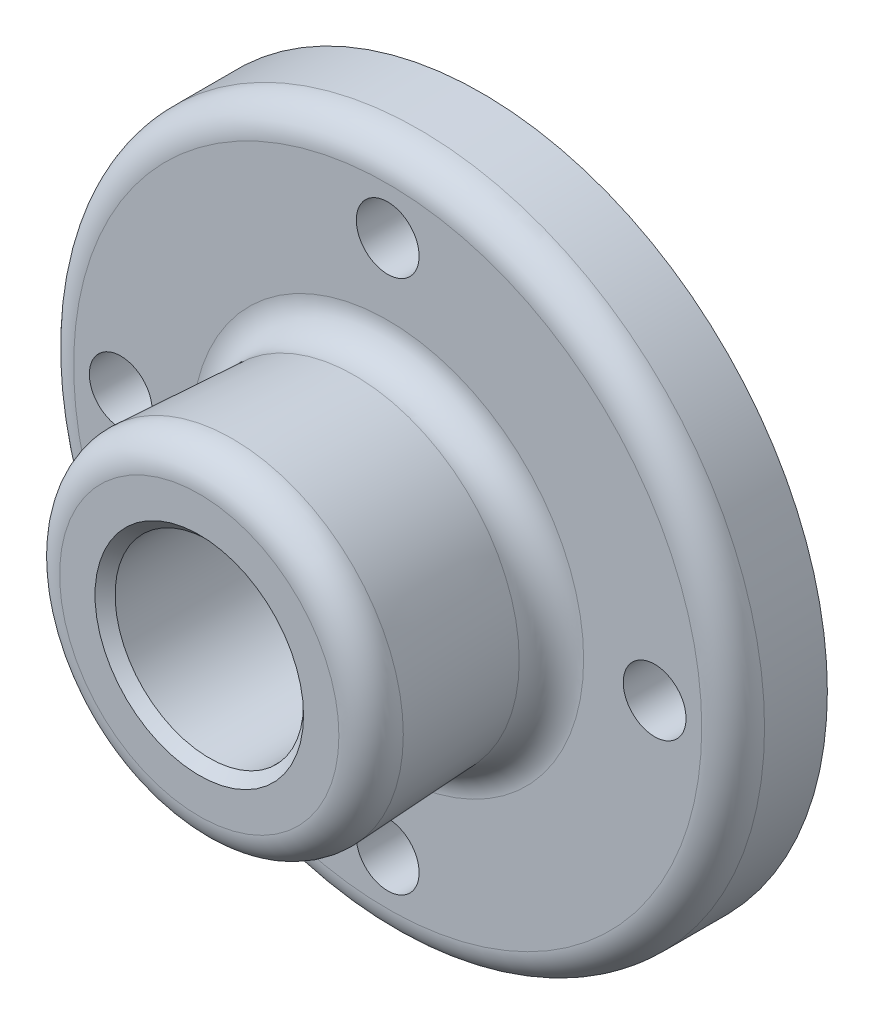
ISO-10303-21;
HEADER;
FILE_DESCRIPTION(('STEP AP214'),'2;1');
FILE_NAME('part.step','',(''),(''),'','','');
FILE_SCHEMA(('AUTOMOTIVE_DESIGN { 1 0 10303 214 1 1 1 1 }'));
ENDSEC;
DATA;
#1=APPLICATION_CONTEXT('core data for automotive mechanical design processes');
#2=APPLICATION_PROTOCOL_DEFINITION('international standard','automotive_design',2000,#1);
#3=PRODUCT_CONTEXT('',#1,'mechanical');
#4=PRODUCT('Part','Part','',(#3));
#5=PRODUCT_RELATED_PRODUCT_CATEGORY('part','',(#4));
#6=PRODUCT_DEFINITION_FORMATION('','',#4);
#7=PRODUCT_DEFINITION_CONTEXT('part definition',#1,'design');
#8=PRODUCT_DEFINITION('design','',#6,#7);
#9=PRODUCT_DEFINITION_SHAPE('','',#8);
#10=(LENGTH_UNIT() NAMED_UNIT(*) SI_UNIT(.MILLI.,.METRE.));
#11=(NAMED_UNIT(*) PLANE_ANGLE_UNIT() SI_UNIT($,.RADIAN.));
#12=(NAMED_UNIT(*) SI_UNIT($,.STERADIAN.) SOLID_ANGLE_UNIT());
#13=UNCERTAINTY_MEASURE_WITH_UNIT(LENGTH_MEASURE(1.E-05),#10,'distance_accuracy_value','');
#14=(GEOMETRIC_REPRESENTATION_CONTEXT(3) GLOBAL_UNCERTAINTY_ASSIGNED_CONTEXT((#13)) GLOBAL_UNIT_ASSIGNED_CONTEXT((#10,
#11,#12)) REPRESENTATION_CONTEXT('',''));
#15=CARTESIAN_POINT('',(0.,0.,0.));
#16=DIRECTION('',(0.,0.,1.));
#17=DIRECTION('',(1.,0.,0.));
#18=AXIS2_PLACEMENT_3D('',#15,#16,#17);
#19=CARTESIAN_POINT('',(0.,0.,19.05));
#20=DIRECTION('',(0.,0.,-1.));
#21=DIRECTION('',(-1.,0.,0.));
#22=AXIS2_PLACEMENT_3D('',#19,#20,#21);
#23=CYLINDRICAL_SURFACE('',#22,69.85);
#24=CARTESIAN_POINT('',(0.,0.,12.7));
#25=DIRECTION('',(0.,0.,1.));
#26=DIRECTION('',(1.,0.,0.));
#27=AXIS2_PLACEMENT_3D('',#24,#25,#26);
#28=CIRCLE('',#27,69.85);
#29=CARTESIAN_POINT('',(69.85,0.,12.7));
#30=VERTEX_POINT('',#29);
#31=EDGE_CURVE('E59',#30,#30,#28,.F.);
#32=ORIENTED_EDGE('',*,*,#31,.T.);
#33=EDGE_LOOP('',(#32));
#34=FACE_BOUND('',#33,.T.);
#35=CARTESIAN_POINT('',(0.,0.,0.));
#36=DIRECTION('',(0.,0.,1.));
#37=DIRECTION('',(1.,0.,0.));
#38=AXIS2_PLACEMENT_3D('',#35,#36,#37);
#39=CIRCLE('',#38,69.85);
#40=CARTESIAN_POINT('',(69.85,0.,0.));
#41=VERTEX_POINT('',#40);
#42=EDGE_CURVE('E68',#41,#41,#39,.T.);
#43=ORIENTED_EDGE('',*,*,#42,.T.);
#44=EDGE_LOOP('',(#43));
#45=FACE_BOUND('',#44,.T.);
#46=ADVANCED_FACE('F35',(#34,#45),#23,.T.);
#47=CARTESIAN_POINT('',(0.,0.,19.05));
#48=DIRECTION('',(0.,0.,1.));
#49=DIRECTION('',(1.,0.,0.));
#50=AXIS2_PLACEMENT_3D('',#47,#48,#49);
#51=PLANE('',#50);
#52=CARTESIAN_POINT('',(0.,0.,19.05));
#53=DIRECTION('',(0.,0.,1.));
#54=DIRECTION('',(1.,0.,0.));
#55=AXIS2_PLACEMENT_3D('',#52,#53,#54);
#56=CIRCLE('',#55,63.5);
#57=CARTESIAN_POINT('',(63.5,0.,19.05));
#58=VERTEX_POINT('',#57);
#59=EDGE_CURVE('E62',#58,#58,#56,.T.);
#60=ORIENTED_EDGE('',*,*,#59,.T.);
#61=EDGE_LOOP('',(#60));
#62=FACE_BOUND('',#61,.T.);
#63=CARTESIAN_POINT('',(0.,0.,19.05));
#64=DIRECTION('',(0.,0.,1.));
#65=DIRECTION('',(1.,0.,0.));
#66=AXIS2_PLACEMENT_3D('',#63,#64,#65);
#67=CIRCLE('',#66,39.6197674048502);
#68=CARTESIAN_POINT('',(39.6197674048502,0.,19.05));
#69=VERTEX_POINT('',#68);
#70=EDGE_CURVE('E65',#69,#69,#67,.F.);
#71=ORIENTED_EDGE('',*,*,#70,.T.);
#72=EDGE_LOOP('',(#71));
#73=FACE_BOUND('',#72,.T.);
#74=CARTESIAN_POINT('',(53.975,-1.88452705264058E-13,19.05));
#75=DIRECTION('',(0.,0.,1.));
#76=DIRECTION('',(0.,-1.,0.));
#77=AXIS2_PLACEMENT_3D('',#74,#75,#76);
#78=CIRCLE('',#77,6.35);
#79=CARTESIAN_POINT('',(53.975,-6.35000000000019,19.05));
#80=VERTEX_POINT('',#79);
#81=EDGE_CURVE('E93',#80,#80,#78,.T.);
#82=ORIENTED_EDGE('',*,*,#81,.F.);
#83=EDGE_LOOP('',(#82));
#84=FACE_BOUND('',#83,.T.);
#85=CARTESIAN_POINT('',(0.,-53.975,19.05));
#86=DIRECTION('',(0.,0.,1.));
#87=DIRECTION('',(-1.,0.,0.));
#88=AXIS2_PLACEMENT_3D('',#85,#86,#87);
#89=CIRCLE('',#88,6.35);
#90=CARTESIAN_POINT('',(-6.35,-53.975,19.05));
#91=VERTEX_POINT('',#90);
#92=EDGE_CURVE('E87',#91,#91,#89,.T.);
#93=ORIENTED_EDGE('',*,*,#92,.F.);
#94=EDGE_LOOP('',(#93));
#95=FACE_BOUND('',#94,.T.);
#96=CARTESIAN_POINT('',(-53.975,5.65358115792174E-13,19.05));
#97=DIRECTION('',(0.,0.,1.));
#98=DIRECTION('',(0.,1.,0.));
#99=AXIS2_PLACEMENT_3D('',#96,#97,#98);
#100=CIRCLE('',#99,6.35);
#101=CARTESIAN_POINT('',(-53.9749999999999,6.35000000000057,19.05));
#102=VERTEX_POINT('',#101);
#103=EDGE_CURVE('E81',#102,#102,#100,.T.);
#104=ORIENTED_EDGE('',*,*,#103,.F.);
#105=EDGE_LOOP('',(#104));
#106=FACE_BOUND('',#105,.T.);
#107=CARTESIAN_POINT('',(0.,53.975,19.05));
#108=DIRECTION('',(0.,0.,1.));
#109=DIRECTION('',(1.,0.,0.));
#110=AXIS2_PLACEMENT_3D('',#107,#108,#109);
#111=CIRCLE('',#110,6.35);
#112=CARTESIAN_POINT('',(6.35,53.975,19.05));
#113=VERTEX_POINT('',#112);
#114=EDGE_CURVE('E75',#113,#113,#111,.T.);
#115=ORIENTED_EDGE('',*,*,#114,.F.);
#116=EDGE_LOOP('',(#115));
#117=FACE_BOUND('',#116,.T.);
#118=ADVANCED_FACE('F110',(#62,#73,#84,#95,#106,#117),#51,.T.);
#119=CARTESIAN_POINT('',(0.,0.,0.));
#120=DIRECTION('',(0.,0.,1.));
#121=DIRECTION('',(1.,0.,0.));
#122=AXIS2_PLACEMENT_3D('',#119,#120,#121);
#123=PLANE('',#122);
#124=CARTESIAN_POINT('',(53.975,-1.88452705264058E-13,0.));
#125=DIRECTION('',(0.,0.,1.));
#126=DIRECTION('',(0.,-1.,0.));
#127=AXIS2_PLACEMENT_3D('',#124,#125,#126);
#128=CIRCLE('',#127,6.35);
#129=CARTESIAN_POINT('',(53.975,-6.35000000000019,0.));
#130=VERTEX_POINT('',#129);
#131=EDGE_CURVE('E78',#130,#130,#128,.T.);
#132=ORIENTED_EDGE('',*,*,#131,.T.);
#133=EDGE_LOOP('',(#132));
#134=FACE_BOUND('',#133,.T.);
#135=CARTESIAN_POINT('',(0.,-53.975,0.));
#136=DIRECTION('',(0.,0.,1.));
#137=DIRECTION('',(-1.,0.,0.));
#138=AXIS2_PLACEMENT_3D('',#135,#136,#137);
#139=CIRCLE('',#138,6.35);
#140=CARTESIAN_POINT('',(-6.35,-53.975,0.));
#141=VERTEX_POINT('',#140);
#142=EDGE_CURVE('E90',#141,#141,#139,.T.);
#143=ORIENTED_EDGE('',*,*,#142,.T.);
#144=EDGE_LOOP('',(#143));
#145=FACE_BOUND('',#144,.T.);
#146=CARTESIAN_POINT('',(-53.975,5.65358115792174E-13,0.));
#147=DIRECTION('',(0.,0.,1.));
#148=DIRECTION('',(0.,1.,0.));
#149=AXIS2_PLACEMENT_3D('',#146,#147,#148);
#150=CIRCLE('',#149,6.35);
#151=CARTESIAN_POINT('',(-53.9749999999999,6.35000000000057,0.));
#152=VERTEX_POINT('',#151);
#153=EDGE_CURVE('E84',#152,#152,#150,.T.);
#154=ORIENTED_EDGE('',*,*,#153,.T.);
#155=EDGE_LOOP('',(#154));
#156=FACE_BOUND('',#155,.T.);
#157=CARTESIAN_POINT('',(0.,53.975,0.));
#158=DIRECTION('',(0.,0.,1.));
#159=DIRECTION('',(1.,0.,0.));
#160=AXIS2_PLACEMENT_3D('',#157,#158,#159);
#161=CIRCLE('',#160,6.35);
#162=CARTESIAN_POINT('',(6.35,53.975,0.));
#163=VERTEX_POINT('',#162);
#164=EDGE_CURVE('E74',#163,#163,#161,.T.);
#165=ORIENTED_EDGE('',*,*,#164,.T.);
#166=EDGE_LOOP('',(#165));
#167=FACE_BOUND('',#166,.T.);
#168=CARTESIAN_POINT('',(0.,0.,0.));
#169=DIRECTION('',(0.,0.,1.));
#170=DIRECTION('',(1.,0.,0.));
#171=AXIS2_PLACEMENT_3D('',#168,#169,#170);
#172=CIRCLE('',#171,19.05);
#173=CARTESIAN_POINT('',(19.05,0.,0.));
#174=VERTEX_POINT('',#173);
#175=EDGE_CURVE('E71',#174,#174,#172,.T.);
#176=ORIENTED_EDGE('',*,*,#175,.T.);
#177=EDGE_LOOP('',(#176));
#178=FACE_BOUND('',#177,.T.);
#179=ORIENTED_EDGE('',*,*,#42,.F.);
#180=EDGE_LOOP('',(#179));
#181=FACE_BOUND('',#180,.T.);
#182=ADVANCED_FACE('F99',(#134,#145,#156,#167,#178,#181),#123,.F.);
#183=CARTESIAN_POINT('',(0.,0.,57.15));
#184=DIRECTION('',(0.,0.,1.));
#185=DIRECTION('',(1.,0.,0.));
#186=AXIS2_PLACEMENT_3D('',#183,#184,#185);
#187=CONICAL_SURFACE('',#186,34.925,0.05235987755983);
#188=CARTESIAN_POINT('',(0.,0.,25.7323333221427));
#189=DIRECTION('',(0.,0.,1.));
#190=DIRECTION('',(1.,0.,0.));
#191=AXIS2_PLACEMENT_3D('',#188,#189,#190);
#192=CIRCLE('',#191,33.2784698591587);
#193=CARTESIAN_POINT('',(33.2784698591587,0.,25.7323333221427));
#194=VERTEX_POINT('',#193);
#195=EDGE_CURVE('E51',#194,#194,#192,.T.);
#196=ORIENTED_EDGE('',*,*,#195,.T.);
#197=EDGE_LOOP('',(#196));
#198=FACE_BOUND('',#197,.T.);
#199=CARTESIAN_POINT('',(0.,0.,50.4676666778574));
#200=DIRECTION('',(0.,0.,-1.));
#201=DIRECTION('',(-1.,0.,0.));
#202=AXIS2_PLACEMENT_3D('',#199,#200,#201);
#203=CIRCLE('',#202,34.5747937501574);
#204=CARTESIAN_POINT('',(-34.5747937501574,0.,50.4676666778574));
#205=VERTEX_POINT('',#204);
#206=EDGE_CURVE('E56',#205,#205,#203,.T.);
#207=ORIENTED_EDGE('',*,*,#206,.T.);
#208=EDGE_LOOP('',(#207));
#209=FACE_BOUND('',#208,.T.);
#210=ADVANCED_FACE('F162',(#198,#209),#187,.T.);
#211=CARTESIAN_POINT('',(0.,0.,57.15));
#212=DIRECTION('',(0.,0.,1.));
#213=DIRECTION('',(1.,0.,0.));
#214=AXIS2_PLACEMENT_3D('',#211,#212,#213);
#215=PLANE('',#214);
#216=CARTESIAN_POINT('',(0.,0.,57.15));
#217=DIRECTION('',(0.,0.,1.));
#218=DIRECTION('',(1.,0.,0.));
#219=AXIS2_PLACEMENT_3D('',#216,#217,#218);
#220=CIRCLE('',#219,21.0820000000001);
#221=CARTESIAN_POINT('',(21.0820000000001,0.,57.15));
#222=VERTEX_POINT('',#221);
#223=EDGE_CURVE('E10',#222,#222,#220,.F.);
#224=ORIENTED_EDGE('',*,*,#223,.T.);
#225=EDGE_LOOP('',(#224));
#226=FACE_BOUND('',#225,.T.);
#227=CARTESIAN_POINT('',(0.,0.,57.15));
#228=DIRECTION('',(0.,0.,1.));
#229=DIRECTION('',(1.,0.,0.));
#230=AXIS2_PLACEMENT_3D('',#227,#228,#229);
#231=CIRCLE('',#230,28.2334962044659);
#232=CARTESIAN_POINT('',(28.2334962044659,0.,57.15));
#233=VERTEX_POINT('',#232);
#234=EDGE_CURVE('E47',#233,#233,#231,.T.);
#235=ORIENTED_EDGE('',*,*,#234,.T.);
#236=EDGE_LOOP('',(#235));
#237=FACE_BOUND('',#236,.T.);
#238=ADVANCED_FACE('F133',(#226,#237),#215,.T.);
#239=CARTESIAN_POINT('',(0.,0.,0.));
#240=DIRECTION('',(0.,0.,1.));
#241=DIRECTION('',(1.,0.,0.));
#242=AXIS2_PLACEMENT_3D('',#239,#240,#241);
#243=CYLINDRICAL_SURFACE('',#242,19.05);
#244=CARTESIAN_POINT('',(0.,0.,55.1179999999999));
#245=DIRECTION('',(0.,0.,1.));
#246=DIRECTION('',(1.,0.,0.));
#247=AXIS2_PLACEMENT_3D('',#244,#245,#246);
#248=CIRCLE('',#247,19.05);
#249=CARTESIAN_POINT('',(19.05,0.,55.1179999999999));
#250=VERTEX_POINT('',#249);
#251=EDGE_CURVE('E43',#250,#250,#248,.T.);
#252=ORIENTED_EDGE('',*,*,#251,.T.);
#253=EDGE_LOOP('',(#252));
#254=FACE_BOUND('',#253,.T.);
#255=ORIENTED_EDGE('',*,*,#175,.F.);
#256=EDGE_LOOP('',(#255));
#257=FACE_BOUND('',#256,.T.);
#258=ADVANCED_FACE('F124',(#254,#257),#243,.F.);
#259=CARTESIAN_POINT('',(0.,53.975,0.));
#260=DIRECTION('',(0.,0.,1.));
#261=DIRECTION('',(1.,0.,0.));
#262=AXIS2_PLACEMENT_3D('',#259,#260,#261);
#263=CYLINDRICAL_SURFACE('',#262,6.35);
#264=ORIENTED_EDGE('',*,*,#164,.F.);
#265=EDGE_LOOP('',(#264));
#266=FACE_BOUND('',#265,.T.);
#267=ORIENTED_EDGE('',*,*,#114,.T.);
#268=EDGE_LOOP('',(#267));
#269=FACE_BOUND('',#268,.T.);
#270=ADVANCED_FACE('F121',(#266,#269),#263,.F.);
#271=CARTESIAN_POINT('',(-53.975,5.65358115792174E-13,0.));
#272=DIRECTION('',(0.,0.,1.));
#273=DIRECTION('',(1.,0.,0.));
#274=AXIS2_PLACEMENT_3D('',#271,#272,#273);
#275=CYLINDRICAL_SURFACE('',#274,6.35);
#276=ORIENTED_EDGE('',*,*,#153,.F.);
#277=EDGE_LOOP('',(#276));
#278=FACE_BOUND('',#277,.T.);
#279=ORIENTED_EDGE('',*,*,#103,.T.);
#280=EDGE_LOOP('',(#279));
#281=FACE_BOUND('',#280,.T.);
#282=ADVANCED_FACE('F123',(#278,#281),#275,.F.);
#283=CARTESIAN_POINT('',(0.,-53.975,0.));
#284=DIRECTION('',(0.,0.,1.));
#285=DIRECTION('',(1.,0.,0.));
#286=AXIS2_PLACEMENT_3D('',#283,#284,#285);
#287=CYLINDRICAL_SURFACE('',#286,6.35);
#288=ORIENTED_EDGE('',*,*,#142,.F.);
#289=EDGE_LOOP('',(#288));
#290=FACE_BOUND('',#289,.T.);
#291=ORIENTED_EDGE('',*,*,#92,.T.);
#292=EDGE_LOOP('',(#291));
#293=FACE_BOUND('',#292,.T.);
#294=ADVANCED_FACE('F106',(#290,#293),#287,.F.);
#295=CARTESIAN_POINT('',(53.975,-1.88452705264058E-13,0.));
#296=DIRECTION('',(0.,0.,1.));
#297=DIRECTION('',(1.,0.,0.));
#298=AXIS2_PLACEMENT_3D('',#295,#296,#297);
#299=CYLINDRICAL_SURFACE('',#298,6.35);
#300=ORIENTED_EDGE('',*,*,#131,.F.);
#301=EDGE_LOOP('',(#300));
#302=FACE_BOUND('',#301,.T.);
#303=ORIENTED_EDGE('',*,*,#81,.T.);
#304=EDGE_LOOP('',(#303));
#305=FACE_BOUND('',#304,.T.);
#306=ADVANCED_FACE('F102',(#302,#305),#299,.F.);
#307=CARTESIAN_POINT('',(0.,0.,12.7));
#308=DIRECTION('',(0.,0.,1.));
#309=DIRECTION('',(1.,0.,0.));
#310=AXIS2_PLACEMENT_3D('',#307,#308,#309);
#311=TOROIDAL_SURFACE('',#310,63.5,6.35);
#312=ORIENTED_EDGE('',*,*,#31,.F.);
#313=EDGE_LOOP('',(#312));
#314=FACE_BOUND('',#313,.T.);
#315=ORIENTED_EDGE('',*,*,#59,.F.);
#316=EDGE_LOOP('',(#315));
#317=FACE_BOUND('',#316,.T.);
#318=ADVANCED_FACE('F105',(#314,#317),#311,.T.);
#319=CARTESIAN_POINT('',(0.,0.,25.4));
#320=DIRECTION('',(0.,0.,1.));
#321=DIRECTION('',(1.,0.,0.));
#322=AXIS2_PLACEMENT_3D('',#319,#320,#321);
#323=TOROIDAL_SURFACE('',#322,39.6197674048502,6.35);
#324=ORIENTED_EDGE('',*,*,#195,.F.);
#325=EDGE_LOOP('',(#324));
#326=FACE_BOUND('',#325,.T.);
#327=ORIENTED_EDGE('',*,*,#70,.F.);
#328=EDGE_LOOP('',(#327));
#329=FACE_BOUND('',#328,.T.);
#330=ADVANCED_FACE('F146',(#326,#329),#323,.F.);
#331=CARTESIAN_POINT('',(0.,0.,50.8));
#332=DIRECTION('',(0.,0.,1.));
#333=DIRECTION('',(1.,0.,0.));
#334=AXIS2_PLACEMENT_3D('',#331,#332,#333);
#335=TOROIDAL_SURFACE('',#334,28.2334962044659,6.35);
#336=ORIENTED_EDGE('',*,*,#206,.F.);
#337=EDGE_LOOP('',(#336));
#338=FACE_BOUND('',#337,.T.);
#339=ORIENTED_EDGE('',*,*,#234,.F.);
#340=EDGE_LOOP('',(#339));
#341=FACE_BOUND('',#340,.T.);
#342=ADVANCED_FACE('F149',(#338,#341),#335,.T.);
#343=CARTESIAN_POINT('',(0.,0.,55.1179999999999));
#344=DIRECTION('',(0.,0.,1.));
#345=DIRECTION('',(1.,0.,0.));
#346=AXIS2_PLACEMENT_3D('',#343,#344,#345);
#347=CONICAL_SURFACE('',#346,19.05,0.785398163397452);
#348=ORIENTED_EDGE('',*,*,#223,.F.);
#349=EDGE_LOOP('',(#348));
#350=FACE_BOUND('',#349,.T.);
#351=ORIENTED_EDGE('',*,*,#251,.F.);
#352=EDGE_LOOP('',(#351));
#353=FACE_BOUND('',#352,.T.);
#354=ADVANCED_FACE('F38',(#350,#353),#347,.F.);
#355=CLOSED_SHELL('',(#46,#118,#182,#210,#238,#258,#270,#282,#294,#306,#318,#330,#342,#354));
#356=MANIFOLD_SOLID_BREP('B2',#355);
#357=ADVANCED_BREP_SHAPE_REPRESENTATION('',(#18,#356),#14);
#358=SHAPE_DEFINITION_REPRESENTATION(#9,#357);
ENDSEC;
END-ISO-10303-21;
